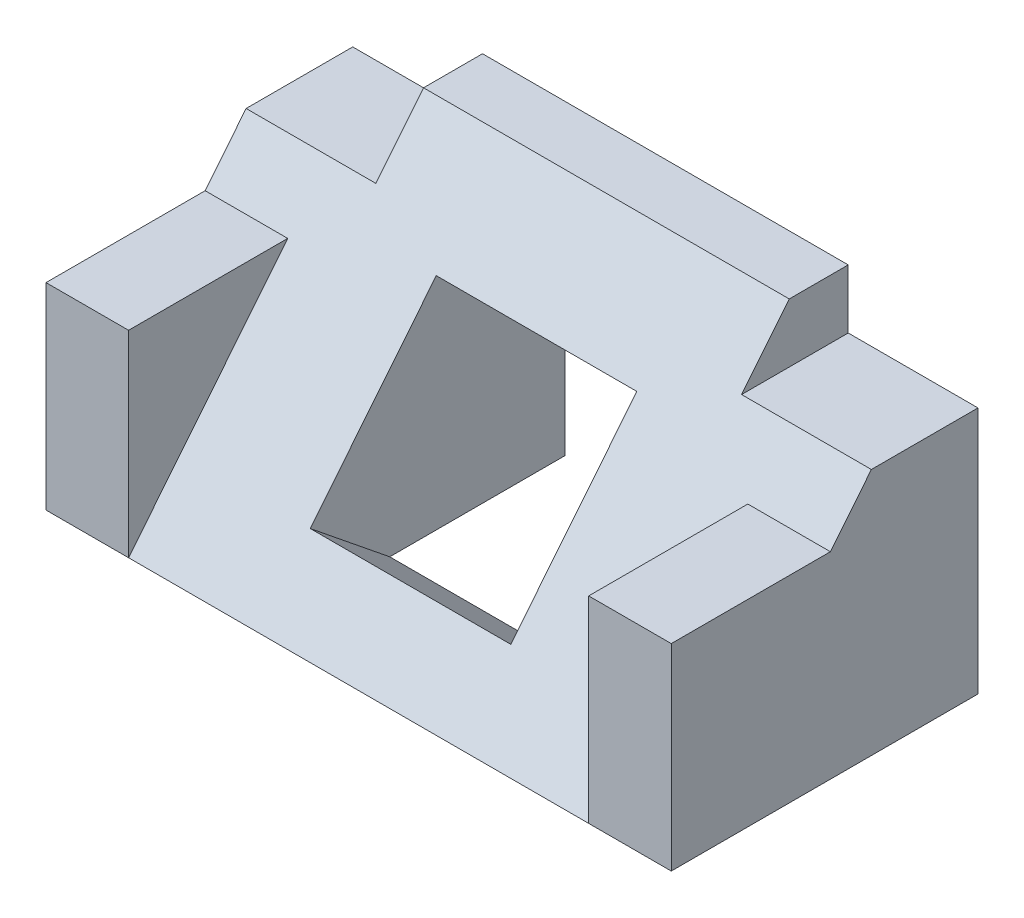
ISO-10303-21;
HEADER;
FILE_DESCRIPTION(('STEP AP214'),'2;1');
FILE_NAME('part.step','',(''),(''),'','','');
FILE_SCHEMA(('AUTOMOTIVE_DESIGN { 1 0 10303 214 1 1 1 1 }'));
ENDSEC;
DATA;
#1=APPLICATION_CONTEXT('core data for automotive mechanical design processes');
#2=APPLICATION_PROTOCOL_DEFINITION('international standard','automotive_design',2000,#1);
#3=PRODUCT_CONTEXT('',#1,'mechanical');
#4=PRODUCT('Part','Part','',(#3));
#5=PRODUCT_RELATED_PRODUCT_CATEGORY('part','',(#4));
#6=PRODUCT_DEFINITION_FORMATION('','',#4);
#7=PRODUCT_DEFINITION_CONTEXT('part definition',#1,'design');
#8=PRODUCT_DEFINITION('design','',#6,#7);
#9=PRODUCT_DEFINITION_SHAPE('','',#8);
#10=(LENGTH_UNIT() NAMED_UNIT(*) SI_UNIT(.MILLI.,.METRE.));
#11=(NAMED_UNIT(*) PLANE_ANGLE_UNIT() SI_UNIT($,.RADIAN.));
#12=(NAMED_UNIT(*) SI_UNIT($,.STERADIAN.) SOLID_ANGLE_UNIT());
#13=UNCERTAINTY_MEASURE_WITH_UNIT(LENGTH_MEASURE(1.E-05),#10,'distance_accuracy_value','');
#14=(GEOMETRIC_REPRESENTATION_CONTEXT(3) GLOBAL_UNCERTAINTY_ASSIGNED_CONTEXT((#13)) GLOBAL_UNIT_ASSIGNED_CONTEXT((#10,
#11,#12)) REPRESENTATION_CONTEXT('',''));
#15=CARTESIAN_POINT('',(0.,0.,0.));
#16=DIRECTION('',(0.,0.,1.));
#17=DIRECTION('',(1.,0.,0.));
#18=AXIS2_PLACEMENT_3D('',#15,#16,#17);
#19=CARTESIAN_POINT('',(199.882267114351,0.,0.));
#20=DIRECTION('',(0.,0.628337107087621,0.777941180203721));
#21=DIRECTION('',(0.,-0.777941180203722,0.628337107087621));
#22=AXIS2_PLACEMENT_3D('',#19,#20,#21);
#23=PLANE('',#22);
#24=DIRECTION('',(-1.,0.,0.));
#25=VECTOR('',#24,1.);
#26=CARTESIAN_POINT('',(7.,16.7,-13.4884615384615));
#27=LINE('',#26,#25);
#28=CARTESIAN_POINT('',(7.,16.7,-13.4884615384615));
#29=VERTEX_POINT('',#28);
#30=CARTESIAN_POINT('',(0.,16.7,-13.4884615384615));
#31=VERTEX_POINT('',#30);
#32=EDGE_CURVE('E197',#29,#31,#27,.T.);
#33=ORIENTED_EDGE('',*,*,#32,.F.);
#34=DIRECTION('',(0.,-0.777941180203722,0.628337107087621));
#35=VECTOR('',#34,1.);
#36=CARTESIAN_POINT('',(7.,0.,0.));
#37=LINE('',#36,#35);
#38=CARTESIAN_POINT('',(7.,0.,0.));
#39=VERTEX_POINT('',#38);
#40=EDGE_CURVE('E185',#29,#39,#37,.T.);
#41=ORIENTED_EDGE('',*,*,#40,.T.);
#42=DIRECTION('',(-1.,0.,0.));
#43=VECTOR('',#42,1.);
#44=CARTESIAN_POINT('',(53.,0.,0.));
#45=LINE('',#44,#43);
#46=CARTESIAN_POINT('',(46.,0.,0.));
#47=VERTEX_POINT('',#46);
#48=EDGE_CURVE('E194',#47,#39,#45,.T.);
#49=ORIENTED_EDGE('',*,*,#48,.F.);
#50=DIRECTION('',(0.,0.777941180203722,-0.628337107087621));
#51=VECTOR('',#50,1.);
#52=CARTESIAN_POINT('',(46.,16.7,-13.4884615384615));
#53=LINE('',#52,#51);
#54=CARTESIAN_POINT('',(46.,16.7,-13.4884615384615));
#55=VERTEX_POINT('',#54);
#56=EDGE_CURVE('E379',#47,#55,#53,.T.);
#57=ORIENTED_EDGE('',*,*,#56,.T.);
#58=DIRECTION('',(1.,0.,0.));
#59=VECTOR('',#58,1.);
#60=CARTESIAN_POINT('',(46.,16.7,-13.4884615384615));
#61=LINE('',#60,#59);
#62=CARTESIAN_POINT('',(53.,16.7,-13.4884615384615));
#63=VERTEX_POINT('',#62);
#64=EDGE_CURVE('E369',#55,#63,#61,.T.);
#65=ORIENTED_EDGE('',*,*,#64,.T.);
#66=DIRECTION('',(0.,0.777941180203722,-0.628337107087621));
#67=VECTOR('',#66,1.);
#68=CARTESIAN_POINT('',(53.,0.,0.));
#69=LINE('',#68,#67);
#70=CARTESIAN_POINT('',(53.,21.,-16.9615384615385));
#71=VERTEX_POINT('',#70);
#72=EDGE_CURVE('E238',#63,#71,#69,.T.);
#73=ORIENTED_EDGE('',*,*,#72,.T.);
#74=DIRECTION('',(1.,0.,0.));
#75=VECTOR('',#74,1.);
#76=CARTESIAN_POINT('',(199.882267114351,21.,-16.9615384615385));
#77=LINE('',#76,#75);
#78=CARTESIAN_POINT('',(42.,21.,-16.9615384615385));
#79=VERTEX_POINT('',#78);
#80=EDGE_CURVE('E50',#79,#71,#77,.T.);
#81=ORIENTED_EDGE('',*,*,#80,.F.);
#82=DIRECTION('',(0.,-0.777941180203722,0.628337107087621));
#83=VECTOR('',#82,1.);
#84=CARTESIAN_POINT('',(42.,0.,0.));
#85=LINE('',#84,#83);
#86=CARTESIAN_POINT('',(42.,26.,-21.));
#87=VERTEX_POINT('',#86);
#88=EDGE_CURVE('E11',#87,#79,#85,.T.);
#89=ORIENTED_EDGE('',*,*,#88,.F.);
#90=DIRECTION('',(-1.,0.,0.));
#91=VECTOR('',#90,1.);
#92=CARTESIAN_POINT('',(199.882267114351,26.,-21.));
#93=LINE('',#92,#91);
#94=CARTESIAN_POINT('',(11.,26.,-21.));
#95=VERTEX_POINT('',#94);
#96=EDGE_CURVE('E270',#87,#95,#93,.T.);
#97=ORIENTED_EDGE('',*,*,#96,.T.);
#98=DIRECTION('',(0.,0.777941180203722,-0.628337107087621));
#99=VECTOR('',#98,1.);
#100=CARTESIAN_POINT('',(11.,0.,0.));
#101=LINE('',#100,#99);
#102=CARTESIAN_POINT('',(11.,21.,-16.9615384615385));
#103=VERTEX_POINT('',#102);
#104=EDGE_CURVE('E217',#103,#95,#101,.T.);
#105=ORIENTED_EDGE('',*,*,#104,.F.);
#106=DIRECTION('',(1.,0.,0.));
#107=VECTOR('',#106,1.);
#108=CARTESIAN_POINT('',(199.882267114351,21.,-16.9615384615385));
#109=LINE('',#108,#107);
#110=CARTESIAN_POINT('',(0.,21.,-16.9615384615385));
#111=VERTEX_POINT('',#110);
#112=EDGE_CURVE('E220',#111,#103,#109,.T.);
#113=ORIENTED_EDGE('',*,*,#112,.F.);
#114=DIRECTION('',(0.,0.777941180203722,-0.628337107087621));
#115=VECTOR('',#114,1.);
#116=CARTESIAN_POINT('',(0.,0.,0.));
#117=LINE('',#116,#115);
#118=EDGE_CURVE('E209',#31,#111,#117,.T.);
#119=ORIENTED_EDGE('',*,*,#118,.F.);
#120=EDGE_LOOP('',(#33,#41,#49,#57,#65,#73,#81,#89,#97,#105,#113,#119));
#121=FACE_BOUND('',#120,.T.);
#122=DIRECTION('',(0.,-0.777941180203721,0.628337107087621));
#123=VECTOR('',#122,1.);
#124=CARTESIAN_POINT('',(18.,5.44558826142605,-4.39835974961335));
#125=LINE('',#124,#123);
#126=CARTESIAN_POINT('',(18.,18.6705883248893,-15.0800905701029));
#127=VERTEX_POINT('',#126);
#128=CARTESIAN_POINT('',(18.,5.44558826142605,-4.39835974961335));
#129=VERTEX_POINT('',#128);
#130=EDGE_CURVE('E365',#127,#129,#125,.T.);
#131=ORIENTED_EDGE('',*,*,#130,.F.);
#132=DIRECTION('',(-1.,0.,0.));
#133=VECTOR('',#132,1.);
#134=CARTESIAN_POINT('',(35.,18.6705883248893,-15.0800905701029));
#135=LINE('',#134,#133);
#136=CARTESIAN_POINT('',(35.,18.6705883248893,-15.0800905701029));
#137=VERTEX_POINT('',#136);
#138=EDGE_CURVE('E348',#137,#127,#135,.T.);
#139=ORIENTED_EDGE('',*,*,#138,.F.);
#140=DIRECTION('',(0.,0.777941180203721,-0.628337107087621));
#141=VECTOR('',#140,1.);
#142=CARTESIAN_POINT('',(35.,5.44558826142605,-4.39835974961335));
#143=LINE('',#142,#141);
#144=CARTESIAN_POINT('',(35.,5.44558826142605,-4.39835974961335));
#145=VERTEX_POINT('',#144);
#146=EDGE_CURVE('E358',#145,#137,#143,.T.);
#147=ORIENTED_EDGE('',*,*,#146,.F.);
#148=DIRECTION('',(1.,0.,0.));
#149=VECTOR('',#148,1.);
#150=CARTESIAN_POINT('',(35.,5.44558826142605,-4.39835974961335));
#151=LINE('',#150,#149);
#152=EDGE_CURVE('E361',#129,#145,#151,.T.);
#153=ORIENTED_EDGE('',*,*,#152,.F.);
#154=EDGE_LOOP('',(#131,#139,#147,#153));
#155=FACE_BOUND('',#154,.T.);
#156=ADVANCED_FACE('F41',(#121,#155),#23,.T.);
#157=CARTESIAN_POINT('',(53.,26.,0.));
#158=DIRECTION('',(0.,-1.,0.));
#159=DIRECTION('',(0.,0.,-1.));
#160=AXIS2_PLACEMENT_3D('',#157,#158,#159);
#161=PLANE('',#160);
#162=ORIENTED_EDGE('',*,*,#96,.F.);
#163=DIRECTION('',(0.,0.,-1.));
#164=VECTOR('',#163,1.);
#165=CARTESIAN_POINT('',(42.,26.,0.));
#166=LINE('',#165,#164);
#167=CARTESIAN_POINT('',(42.,26.,-26.));
#168=VERTEX_POINT('',#167);
#169=EDGE_CURVE('E246',#87,#168,#166,.T.);
#170=ORIENTED_EDGE('',*,*,#169,.T.);
#171=DIRECTION('',(-1.,0.,0.));
#172=VECTOR('',#171,1.);
#173=CARTESIAN_POINT('',(53.,26.,-26.));
#174=LINE('',#173,#172);
#175=CARTESIAN_POINT('',(11.,26.,-26.));
#176=VERTEX_POINT('',#175);
#177=EDGE_CURVE('E283',#168,#176,#174,.T.);
#178=ORIENTED_EDGE('',*,*,#177,.T.);
#179=DIRECTION('',(0.,0.,-1.));
#180=VECTOR('',#179,1.);
#181=CARTESIAN_POINT('',(11.,26.,0.));
#182=LINE('',#181,#180);
#183=EDGE_CURVE('E260',#95,#176,#182,.T.);
#184=ORIENTED_EDGE('',*,*,#183,.F.);
#185=EDGE_LOOP('',(#162,#170,#178,#184));
#186=FACE_BOUND('',#185,.T.);
#187=ADVANCED_FACE('F315',(#186),#161,.F.);
#188=CARTESIAN_POINT('',(53.,0.,0.));
#189=DIRECTION('',(-1.,0.,0.));
#190=DIRECTION('',(0.,0.,1.));
#191=AXIS2_PLACEMENT_3D('',#188,#189,#190);
#192=PLANE('',#191);
#193=DIRECTION('',(0.,1.,0.));
#194=VECTOR('',#193,1.);
#195=CARTESIAN_POINT('',(53.,0.,-26.));
#196=LINE('',#195,#194);
#197=CARTESIAN_POINT('',(53.,0.,-26.));
#198=VERTEX_POINT('',#197);
#199=CARTESIAN_POINT('',(53.,21.,-26.));
#200=VERTEX_POINT('',#199);
#201=EDGE_CURVE('E240',#198,#200,#196,.T.);
#202=ORIENTED_EDGE('',*,*,#201,.T.);
#203=DIRECTION('',(0.,0.,-1.));
#204=VECTOR('',#203,1.);
#205=CARTESIAN_POINT('',(53.,21.,0.));
#206=LINE('',#205,#204);
#207=EDGE_CURVE('E230',#71,#200,#206,.T.);
#208=ORIENTED_EDGE('',*,*,#207,.F.);
#209=ORIENTED_EDGE('',*,*,#72,.F.);
#210=DIRECTION('',(0.,0.,1.));
#211=VECTOR('',#210,1.);
#212=CARTESIAN_POINT('',(53.,16.7,0.));
#213=LINE('',#212,#211);
#214=CARTESIAN_POINT('',(53.,16.7,0.));
#215=VERTEX_POINT('',#214);
#216=EDGE_CURVE('E57',#63,#215,#213,.T.);
#217=ORIENTED_EDGE('',*,*,#216,.T.);
#218=DIRECTION('',(0.,-1.,0.));
#219=VECTOR('',#218,1.);
#220=CARTESIAN_POINT('',(53.,0.,0.));
#221=LINE('',#220,#219);
#222=CARTESIAN_POINT('',(53.,0.,0.));
#223=VERTEX_POINT('',#222);
#224=EDGE_CURVE('E375',#215,#223,#221,.T.);
#225=ORIENTED_EDGE('',*,*,#224,.T.);
#226=DIRECTION('',(0.,0.,-1.));
#227=VECTOR('',#226,1.);
#228=CARTESIAN_POINT('',(53.,0.,0.));
#229=LINE('',#228,#227);
#230=EDGE_CURVE('E277',#223,#198,#229,.T.);
#231=ORIENTED_EDGE('',*,*,#230,.T.);
#232=EDGE_LOOP('',(#202,#208,#209,#217,#225,#231));
#233=FACE_BOUND('',#232,.T.);
#234=ADVANCED_FACE('F237',(#233),#192,.F.);
#235=CARTESIAN_POINT('',(0.,0.,0.));
#236=DIRECTION('',(-1.,0.,0.));
#237=DIRECTION('',(0.,0.,1.));
#238=AXIS2_PLACEMENT_3D('',#235,#236,#237);
#239=PLANE('',#238);
#240=DIRECTION('',(0.,0.,-1.));
#241=VECTOR('',#240,1.);
#242=CARTESIAN_POINT('',(0.,21.,0.));
#243=LINE('',#242,#241);
#244=CARTESIAN_POINT('',(0.,21.,-26.));
#245=VERTEX_POINT('',#244);
#246=EDGE_CURVE('E261',#111,#245,#243,.T.);
#247=ORIENTED_EDGE('',*,*,#246,.T.);
#248=DIRECTION('',(0.,1.,0.));
#249=VECTOR('',#248,1.);
#250=CARTESIAN_POINT('',(0.,0.,-26.));
#251=LINE('',#250,#249);
#252=CARTESIAN_POINT('',(0.,0.,-26.));
#253=VERTEX_POINT('',#252);
#254=EDGE_CURVE('E280',#253,#245,#251,.T.);
#255=ORIENTED_EDGE('',*,*,#254,.F.);
#256=DIRECTION('',(0.,0.,-1.));
#257=VECTOR('',#256,1.);
#258=CARTESIAN_POINT('',(0.,0.,0.));
#259=LINE('',#258,#257);
#260=CARTESIAN_POINT('',(0.,0.,0.));
#261=VERTEX_POINT('',#260);
#262=EDGE_CURVE('E276',#261,#253,#259,.T.);
#263=ORIENTED_EDGE('',*,*,#262,.F.);
#264=DIRECTION('',(0.,1.,0.));
#265=VECTOR('',#264,1.);
#266=CARTESIAN_POINT('',(0.,0.,0.));
#267=LINE('',#266,#265);
#268=CARTESIAN_POINT('',(0.,16.7,0.));
#269=VERTEX_POINT('',#268);
#270=EDGE_CURVE('E173',#261,#269,#267,.T.);
#271=ORIENTED_EDGE('',*,*,#270,.T.);
#272=DIRECTION('',(0.,0.,-1.));
#273=VECTOR('',#272,1.);
#274=CARTESIAN_POINT('',(0.,16.7,0.));
#275=LINE('',#274,#273);
#276=EDGE_CURVE('E199',#269,#31,#275,.T.);
#277=ORIENTED_EDGE('',*,*,#276,.T.);
#278=ORIENTED_EDGE('',*,*,#118,.T.);
#279=EDGE_LOOP('',(#247,#255,#263,#271,#277,#278));
#280=FACE_BOUND('',#279,.T.);
#281=ADVANCED_FACE('F304',(#280),#239,.T.);
#282=CARTESIAN_POINT('',(53.,0.,0.));
#283=DIRECTION('',(0.,1.,0.));
#284=DIRECTION('',(0.,0.,1.));
#285=AXIS2_PLACEMENT_3D('',#282,#283,#284);
#286=PLANE('',#285);
#287=DIRECTION('',(-1.,0.,0.));
#288=VECTOR('',#287,1.);
#289=CARTESIAN_POINT('',(53.,0.,-26.));
#290=LINE('',#289,#288);
#291=CARTESIAN_POINT('',(18.,0.,-26.));
#292=VERTEX_POINT('',#291);
#293=EDGE_CURVE('E211',#292,#253,#290,.T.);
#294=ORIENTED_EDGE('',*,*,#293,.F.);
#295=DIRECTION('',(0.,0.,1.));
#296=VECTOR('',#295,1.);
#297=CARTESIAN_POINT('',(18.,0.,0.));
#298=LINE('',#297,#296);
#299=CARTESIAN_POINT('',(18.,0.,-11.1405166447123));
#300=VERTEX_POINT('',#299);
#301=EDGE_CURVE('E257',#292,#300,#298,.T.);
#302=ORIENTED_EDGE('',*,*,#301,.T.);
#303=DIRECTION('',(1.,0.,0.));
#304=VECTOR('',#303,1.);
#305=CARTESIAN_POINT('',(53.,0.,-11.1405166447123));
#306=LINE('',#305,#304);
#307=CARTESIAN_POINT('',(35.,0.,-11.1405166447123));
#308=VERTEX_POINT('',#307);
#309=EDGE_CURVE('E338',#300,#308,#306,.T.);
#310=ORIENTED_EDGE('',*,*,#309,.T.);
#311=DIRECTION('',(0.,0.,-1.));
#312=VECTOR('',#311,1.);
#313=CARTESIAN_POINT('',(35.,0.,0.));
#314=LINE('',#313,#312);
#315=CARTESIAN_POINT('',(35.,0.,-26.));
#316=VERTEX_POINT('',#315);
#317=EDGE_CURVE('E330',#308,#316,#314,.T.);
#318=ORIENTED_EDGE('',*,*,#317,.T.);
#319=EDGE_CURVE('E205',#198,#316,#290,.T.);
#320=ORIENTED_EDGE('',*,*,#319,.F.);
#321=ORIENTED_EDGE('',*,*,#230,.F.);
#322=EDGE_CURVE('E203',#223,#47,#45,.T.);
#323=ORIENTED_EDGE('',*,*,#322,.T.);
#324=ORIENTED_EDGE('',*,*,#48,.T.);
#325=DIRECTION('',(-1.,0.,0.));
#326=VECTOR('',#325,1.);
#327=CARTESIAN_POINT('',(7.,0.,0.));
#328=LINE('',#327,#326);
#329=EDGE_CURVE('E167',#39,#261,#328,.T.);
#330=ORIENTED_EDGE('',*,*,#329,.T.);
#331=ORIENTED_EDGE('',*,*,#262,.T.);
#332=EDGE_LOOP('',(#294,#302,#310,#318,#320,#321,#323,#324,#330,#331));
#333=FACE_BOUND('',#332,.T.);
#334=ADVANCED_FACE('F43',(#333),#286,.F.);
#335=CARTESIAN_POINT('',(53.,0.,-26.));
#336=DIRECTION('',(0.,0.,1.));
#337=DIRECTION('',(1.,0.,0.));
#338=AXIS2_PLACEMENT_3D('',#335,#336,#337);
#339=PLANE('',#338);
#340=DIRECTION('',(-1.,0.,0.));
#341=VECTOR('',#340,1.);
#342=CARTESIAN_POINT('',(53.,9.85066147766475,-26.));
#343=LINE('',#342,#341);
#344=CARTESIAN_POINT('',(35.,9.85066147766474,-26.));
#345=VERTEX_POINT('',#344);
#346=CARTESIAN_POINT('',(18.,9.85066147766474,-26.));
#347=VERTEX_POINT('',#346);
#348=EDGE_CURVE('E327',#345,#347,#343,.T.);
#349=ORIENTED_EDGE('',*,*,#348,.T.);
#350=DIRECTION('',(0.,-1.,0.));
#351=VECTOR('',#350,1.);
#352=CARTESIAN_POINT('',(18.,0.,-26.));
#353=LINE('',#352,#351);
#354=EDGE_CURVE('E301',#347,#292,#353,.T.);
#355=ORIENTED_EDGE('',*,*,#354,.T.);
#356=ORIENTED_EDGE('',*,*,#293,.T.);
#357=ORIENTED_EDGE('',*,*,#254,.T.);
#358=DIRECTION('',(-1.,0.,0.));
#359=VECTOR('',#358,1.);
#360=CARTESIAN_POINT('',(0.,21.,-26.));
#361=LINE('',#360,#359);
#362=CARTESIAN_POINT('',(11.,21.,-26.));
#363=VERTEX_POINT('',#362);
#364=EDGE_CURVE('E256',#363,#245,#361,.T.);
#365=ORIENTED_EDGE('',*,*,#364,.F.);
#366=DIRECTION('',(0.,-1.,0.));
#367=VECTOR('',#366,1.);
#368=CARTESIAN_POINT('',(11.,26.,-26.));
#369=LINE('',#368,#367);
#370=EDGE_CURVE('E252',#176,#363,#369,.T.);
#371=ORIENTED_EDGE('',*,*,#370,.F.);
#372=ORIENTED_EDGE('',*,*,#177,.F.);
#373=DIRECTION('',(0.,1.,0.));
#374=VECTOR('',#373,1.);
#375=CARTESIAN_POINT('',(42.,26.,-26.));
#376=LINE('',#375,#374);
#377=CARTESIAN_POINT('',(42.,21.,-26.));
#378=VERTEX_POINT('',#377);
#379=EDGE_CURVE('E242',#378,#168,#376,.T.);
#380=ORIENTED_EDGE('',*,*,#379,.F.);
#381=DIRECTION('',(-1.,0.,0.));
#382=VECTOR('',#381,1.);
#383=CARTESIAN_POINT('',(53.,21.,-26.));
#384=LINE('',#383,#382);
#385=EDGE_CURVE('E248',#200,#378,#384,.T.);
#386=ORIENTED_EDGE('',*,*,#385,.F.);
#387=ORIENTED_EDGE('',*,*,#201,.F.);
#388=ORIENTED_EDGE('',*,*,#319,.T.);
#389=DIRECTION('',(0.,1.,0.));
#390=VECTOR('',#389,1.);
#391=CARTESIAN_POINT('',(35.,0.,-26.));
#392=LINE('',#391,#390);
#393=EDGE_CURVE('E334',#316,#345,#392,.T.);
#394=ORIENTED_EDGE('',*,*,#393,.T.);
#395=EDGE_LOOP('',(#349,#355,#356,#357,#365,#371,#372,#380,#386,#387,#388,#394));
#396=FACE_BOUND('',#395,.T.);
#397=ADVANCED_FACE('F298',(#396),#339,.F.);
#398=CARTESIAN_POINT('',(0.,21.,0.));
#399=DIRECTION('',(0.,-1.,0.));
#400=DIRECTION('',(0.,0.,-1.));
#401=AXIS2_PLACEMENT_3D('',#398,#399,#400);
#402=PLANE('',#401);
#403=ORIENTED_EDGE('',*,*,#112,.T.);
#404=DIRECTION('',(0.,0.,-1.));
#405=VECTOR('',#404,1.);
#406=CARTESIAN_POINT('',(11.,21.,0.));
#407=LINE('',#406,#405);
#408=EDGE_CURVE('E265',#103,#363,#407,.T.);
#409=ORIENTED_EDGE('',*,*,#408,.T.);
#410=ORIENTED_EDGE('',*,*,#364,.T.);
#411=ORIENTED_EDGE('',*,*,#246,.F.);
#412=EDGE_LOOP('',(#403,#409,#410,#411));
#413=FACE_BOUND('',#412,.T.);
#414=ADVANCED_FACE('F309',(#413),#402,.F.);
#415=CARTESIAN_POINT('',(11.,26.,0.));
#416=DIRECTION('',(1.,0.,0.));
#417=DIRECTION('',(0.,0.,-1.));
#418=AXIS2_PLACEMENT_3D('',#415,#416,#417);
#419=PLANE('',#418);
#420=ORIENTED_EDGE('',*,*,#104,.T.);
#421=ORIENTED_EDGE('',*,*,#183,.T.);
#422=ORIENTED_EDGE('',*,*,#370,.T.);
#423=ORIENTED_EDGE('',*,*,#408,.F.);
#424=EDGE_LOOP('',(#420,#421,#422,#423));
#425=FACE_BOUND('',#424,.T.);
#426=ADVANCED_FACE('F313',(#425),#419,.F.);
#427=CARTESIAN_POINT('',(42.,26.,0.));
#428=DIRECTION('',(-1.,0.,0.));
#429=DIRECTION('',(0.,0.,1.));
#430=AXIS2_PLACEMENT_3D('',#427,#428,#429);
#431=PLANE('',#430);
#432=ORIENTED_EDGE('',*,*,#88,.T.);
#433=DIRECTION('',(0.,0.,-1.));
#434=VECTOR('',#433,1.);
#435=CARTESIAN_POINT('',(42.,21.,0.));
#436=LINE('',#435,#434);
#437=EDGE_CURVE('E232',#79,#378,#436,.T.);
#438=ORIENTED_EDGE('',*,*,#437,.T.);
#439=ORIENTED_EDGE('',*,*,#379,.T.);
#440=ORIENTED_EDGE('',*,*,#169,.F.);
#441=EDGE_LOOP('',(#432,#438,#439,#440));
#442=FACE_BOUND('',#441,.T.);
#443=ADVANCED_FACE('F319',(#442),#431,.F.);
#444=CARTESIAN_POINT('',(53.,21.,0.));
#445=DIRECTION('',(0.,-1.,0.));
#446=DIRECTION('',(0.,0.,-1.));
#447=AXIS2_PLACEMENT_3D('',#444,#445,#446);
#448=PLANE('',#447);
#449=ORIENTED_EDGE('',*,*,#80,.T.);
#450=ORIENTED_EDGE('',*,*,#207,.T.);
#451=ORIENTED_EDGE('',*,*,#385,.T.);
#452=ORIENTED_EDGE('',*,*,#437,.F.);
#453=EDGE_LOOP('',(#449,#450,#451,#452));
#454=FACE_BOUND('',#453,.T.);
#455=ADVANCED_FACE('F228',(#454),#448,.F.);
#456=CARTESIAN_POINT('',(18.,-7.2634538155659,-20.1333642258891));
#457=DIRECTION('',(-1.,0.,0.));
#458=DIRECTION('',(0.,-1.,0.));
#459=AXIS2_PLACEMENT_3D('',#456,#457,#458);
#460=PLANE('',#459);
#461=ORIENTED_EDGE('',*,*,#354,.F.);
#462=DIRECTION('',(0.,0.628337107087621,0.777941180203721));
#463=VECTOR('',#462,1.);
#464=CARTESIAN_POINT('',(18.,5.96154624789737,-30.8150950463786));
#465=LINE('',#464,#463);
#466=EDGE_CURVE('E342',#347,#127,#465,.T.);
#467=ORIENTED_EDGE('',*,*,#466,.T.);
#468=ORIENTED_EDGE('',*,*,#130,.T.);
#469=DIRECTION('',(0.,0.628337107087621,0.777941180203721));
#470=VECTOR('',#469,1.);
#471=CARTESIAN_POINT('',(18.,-7.2634538155659,-20.1333642258891));
#472=LINE('',#471,#470);
#473=EDGE_CURVE('E343',#300,#129,#472,.T.);
#474=ORIENTED_EDGE('',*,*,#473,.F.);
#475=ORIENTED_EDGE('',*,*,#301,.F.);
#476=EDGE_LOOP('',(#461,#467,#468,#474,#475));
#477=FACE_BOUND('',#476,.T.);
#478=ADVANCED_FACE('F465',(#477),#460,.F.);
#479=CARTESIAN_POINT('',(35.,5.96154624789737,-30.8150950463786));
#480=DIRECTION('',(0.,0.777941180203721,-0.628337107087621));
#481=DIRECTION('',(0.,0.628337107087621,0.777941180203721));
#482=AXIS2_PLACEMENT_3D('',#479,#480,#481);
#483=PLANE('',#482);
#484=DIRECTION('',(0.,0.628337107087621,0.777941180203721));
#485=VECTOR('',#484,1.);
#486=CARTESIAN_POINT('',(35.,5.96154624789737,-30.8150950463786));
#487=LINE('',#486,#485);
#488=EDGE_CURVE('E65',#345,#137,#487,.T.);
#489=ORIENTED_EDGE('',*,*,#488,.T.);
#490=ORIENTED_EDGE('',*,*,#138,.T.);
#491=ORIENTED_EDGE('',*,*,#466,.F.);
#492=ORIENTED_EDGE('',*,*,#348,.F.);
#493=EDGE_LOOP('',(#489,#490,#491,#492));
#494=FACE_BOUND('',#493,.T.);
#495=ADVANCED_FACE('F484',(#494),#483,.F.);
#496=CARTESIAN_POINT('',(35.,-7.26345381556589,-20.1333642258891));
#497=DIRECTION('',(1.,0.,0.));
#498=DIRECTION('',(0.,0.,-1.));
#499=AXIS2_PLACEMENT_3D('',#496,#497,#498);
#500=PLANE('',#499);
#501=DIRECTION('',(0.,0.628337107087621,0.777941180203721));
#502=VECTOR('',#501,1.);
#503=CARTESIAN_POINT('',(35.,-7.26345381556589,-20.1333642258891));
#504=LINE('',#503,#502);
#505=EDGE_CURVE('E347',#308,#145,#504,.T.);
#506=ORIENTED_EDGE('',*,*,#505,.T.);
#507=ORIENTED_EDGE('',*,*,#146,.T.);
#508=ORIENTED_EDGE('',*,*,#488,.F.);
#509=ORIENTED_EDGE('',*,*,#393,.F.);
#510=ORIENTED_EDGE('',*,*,#317,.F.);
#511=EDGE_LOOP('',(#506,#507,#508,#509,#510));
#512=FACE_BOUND('',#511,.T.);
#513=ADVANCED_FACE('F494',(#512),#500,.F.);
#514=CARTESIAN_POINT('',(35.,-7.26345381556589,-20.1333642258891));
#515=DIRECTION('',(0.,-0.777941180203721,0.628337107087621));
#516=DIRECTION('',(0.,-0.628337107087621,-0.777941180203721));
#517=AXIS2_PLACEMENT_3D('',#514,#515,#516);
#518=PLANE('',#517);
#519=ORIENTED_EDGE('',*,*,#473,.T.);
#520=ORIENTED_EDGE('',*,*,#152,.T.);
#521=ORIENTED_EDGE('',*,*,#505,.F.);
#522=ORIENTED_EDGE('',*,*,#309,.F.);
#523=EDGE_LOOP('',(#519,#520,#521,#522));
#524=FACE_BOUND('',#523,.T.);
#525=ADVANCED_FACE('F504',(#524),#518,.F.);
#526=CARTESIAN_POINT('',(46.,0.,0.));
#527=DIRECTION('',(0.,0.,1.));
#528=DIRECTION('',(1.,0.,0.));
#529=AXIS2_PLACEMENT_3D('',#526,#527,#528);
#530=PLANE('',#529);
#531=ORIENTED_EDGE('',*,*,#224,.F.);
#532=DIRECTION('',(1.,0.,0.));
#533=VECTOR('',#532,1.);
#534=CARTESIAN_POINT('',(46.,16.7,0.));
#535=LINE('',#534,#533);
#536=CARTESIAN_POINT('',(46.,16.7,0.));
#537=VERTEX_POINT('',#536);
#538=EDGE_CURVE('E368',#537,#215,#535,.T.);
#539=ORIENTED_EDGE('',*,*,#538,.F.);
#540=DIRECTION('',(0.,-1.,0.));
#541=VECTOR('',#540,1.);
#542=CARTESIAN_POINT('',(46.,0.,0.));
#543=LINE('',#542,#541);
#544=EDGE_CURVE('E372',#537,#47,#543,.T.);
#545=ORIENTED_EDGE('',*,*,#544,.T.);
#546=ORIENTED_EDGE('',*,*,#322,.F.);
#547=EDGE_LOOP('',(#531,#539,#545,#546));
#548=FACE_BOUND('',#547,.T.);
#549=ADVANCED_FACE('F512',(#548),#530,.T.);
#550=CARTESIAN_POINT('',(46.,16.7,0.));
#551=DIRECTION('',(0.,1.,0.));
#552=DIRECTION('',(0.,0.,1.));
#553=AXIS2_PLACEMENT_3D('',#550,#551,#552);
#554=PLANE('',#553);
#555=ORIENTED_EDGE('',*,*,#216,.F.);
#556=ORIENTED_EDGE('',*,*,#64,.F.);
#557=DIRECTION('',(0.,0.,1.));
#558=VECTOR('',#557,1.);
#559=CARTESIAN_POINT('',(46.,16.7,0.));
#560=LINE('',#559,#558);
#561=EDGE_CURVE('E385',#55,#537,#560,.T.);
#562=ORIENTED_EDGE('',*,*,#561,.T.);
#563=ORIENTED_EDGE('',*,*,#538,.T.);
#564=EDGE_LOOP('',(#555,#556,#562,#563));
#565=FACE_BOUND('',#564,.T.);
#566=ADVANCED_FACE('F411',(#565),#554,.T.);
#567=CARTESIAN_POINT('',(46.,0.,0.));
#568=DIRECTION('',(1.,0.,0.));
#569=DIRECTION('',(0.,0.,-1.));
#570=AXIS2_PLACEMENT_3D('',#567,#568,#569);
#571=PLANE('',#570);
#572=ORIENTED_EDGE('',*,*,#56,.F.);
#573=ORIENTED_EDGE('',*,*,#544,.F.);
#574=ORIENTED_EDGE('',*,*,#561,.F.);
#575=EDGE_LOOP('',(#572,#573,#574));
#576=FACE_BOUND('',#575,.T.);
#577=ADVANCED_FACE('F404',(#576),#571,.F.);
#578=CARTESIAN_POINT('',(7.,16.7,0.));
#579=DIRECTION('',(0.,1.,0.));
#580=DIRECTION('',(0.,0.,1.));
#581=AXIS2_PLACEMENT_3D('',#578,#579,#580);
#582=PLANE('',#581);
#583=ORIENTED_EDGE('',*,*,#276,.F.);
#584=DIRECTION('',(-1.,0.,0.));
#585=VECTOR('',#584,1.);
#586=CARTESIAN_POINT('',(7.,16.7,0.));
#587=LINE('',#586,#585);
#588=CARTESIAN_POINT('',(7.,16.7,0.));
#589=VERTEX_POINT('',#588);
#590=EDGE_CURVE('E179',#589,#269,#587,.T.);
#591=ORIENTED_EDGE('',*,*,#590,.F.);
#592=DIRECTION('',(0.,0.,-1.));
#593=VECTOR('',#592,1.);
#594=CARTESIAN_POINT('',(7.,16.7,0.));
#595=LINE('',#594,#593);
#596=EDGE_CURVE('E180',#589,#29,#595,.T.);
#597=ORIENTED_EDGE('',*,*,#596,.T.);
#598=ORIENTED_EDGE('',*,*,#32,.T.);
#599=EDGE_LOOP('',(#583,#591,#597,#598));
#600=FACE_BOUND('',#599,.T.);
#601=ADVANCED_FACE('F402',(#600),#582,.T.);
#602=CARTESIAN_POINT('',(7.,0.,0.));
#603=DIRECTION('',(0.,0.,1.));
#604=DIRECTION('',(1.,0.,0.));
#605=AXIS2_PLACEMENT_3D('',#602,#603,#604);
#606=PLANE('',#605);
#607=ORIENTED_EDGE('',*,*,#270,.F.);
#608=ORIENTED_EDGE('',*,*,#329,.F.);
#609=DIRECTION('',(0.,1.,0.));
#610=VECTOR('',#609,1.);
#611=CARTESIAN_POINT('',(7.,0.,0.));
#612=LINE('',#611,#610);
#613=EDGE_CURVE('E170',#39,#589,#612,.T.);
#614=ORIENTED_EDGE('',*,*,#613,.T.);
#615=ORIENTED_EDGE('',*,*,#590,.T.);
#616=EDGE_LOOP('',(#607,#608,#614,#615));
#617=FACE_BOUND('',#616,.T.);
#618=ADVANCED_FACE('F169',(#617),#606,.T.);
#619=CARTESIAN_POINT('',(7.,0.,0.));
#620=DIRECTION('',(-1.,0.,0.));
#621=DIRECTION('',(0.,0.,1.));
#622=AXIS2_PLACEMENT_3D('',#619,#620,#621);
#623=PLANE('',#622);
#624=ORIENTED_EDGE('',*,*,#40,.F.);
#625=ORIENTED_EDGE('',*,*,#596,.F.);
#626=ORIENTED_EDGE('',*,*,#613,.F.);
#627=EDGE_LOOP('',(#624,#625,#626));
#628=FACE_BOUND('',#627,.T.);
#629=ADVANCED_FACE('F184',(#628),#623,.F.);
#630=CLOSED_SHELL('',(#156,#187,#234,#281,#334,#397,#414,#426,#443,#455,#478,#495,#513,#525,
#549,#566,#577,#601,#618,#629));
#631=MANIFOLD_SOLID_BREP('B2',#630);
#632=ADVANCED_BREP_SHAPE_REPRESENTATION('',(#18,#631),#14);
#633=SHAPE_DEFINITION_REPRESENTATION(#9,#632);
ENDSEC;
END-ISO-10303-21;
